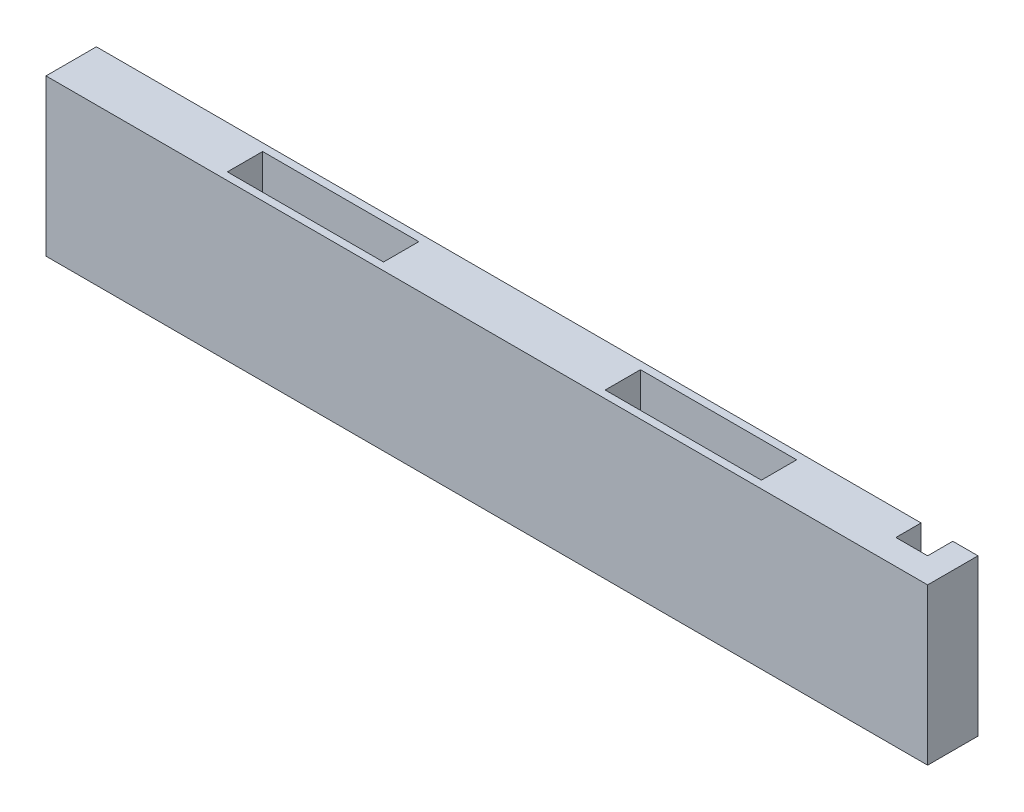
ISO-10303-21;
HEADER;
FILE_DESCRIPTION(('STEP AP214'),'2;1');
FILE_NAME('part.step','',(''),(''),'','','');
FILE_SCHEMA(('AUTOMOTIVE_DESIGN { 1 0 10303 214 1 1 1 1 }'));
ENDSEC;
DATA;
#1=APPLICATION_CONTEXT('core data for automotive mechanical design processes');
#2=APPLICATION_PROTOCOL_DEFINITION('international standard','automotive_design',2000,#1);
#3=PRODUCT_CONTEXT('',#1,'mechanical');
#4=PRODUCT('Part','Part','',(#3));
#5=PRODUCT_RELATED_PRODUCT_CATEGORY('part','',(#4));
#6=PRODUCT_DEFINITION_FORMATION('','',#4);
#7=PRODUCT_DEFINITION_CONTEXT('part definition',#1,'design');
#8=PRODUCT_DEFINITION('design','',#6,#7);
#9=PRODUCT_DEFINITION_SHAPE('','',#8);
#10=(LENGTH_UNIT() NAMED_UNIT(*) SI_UNIT(.MILLI.,.METRE.));
#11=(NAMED_UNIT(*) PLANE_ANGLE_UNIT() SI_UNIT($,.RADIAN.));
#12=(NAMED_UNIT(*) SI_UNIT($,.STERADIAN.) SOLID_ANGLE_UNIT());
#13=UNCERTAINTY_MEASURE_WITH_UNIT(LENGTH_MEASURE(1.E-05),#10,'distance_accuracy_value','');
#14=(GEOMETRIC_REPRESENTATION_CONTEXT(3) GLOBAL_UNCERTAINTY_ASSIGNED_CONTEXT((#13)) GLOBAL_UNIT_ASSIGNED_CONTEXT((#10,
#11,#12)) REPRESENTATION_CONTEXT('',''));
#15=CARTESIAN_POINT('',(0.,0.,0.));
#16=DIRECTION('',(0.,0.,1.));
#17=DIRECTION('',(1.,0.,0.));
#18=AXIS2_PLACEMENT_3D('',#15,#16,#17);
#19=CARTESIAN_POINT('',(0.,0.,0.));
#20=DIRECTION('',(0.,0.,1.));
#21=DIRECTION('',(1.,0.,0.));
#22=AXIS2_PLACEMENT_3D('',#19,#20,#21);
#23=PLANE('',#22);
#24=DIRECTION('',(0.,1.,0.));
#25=VECTOR('',#24,1.);
#26=CARTESIAN_POINT('',(76.2,-15.5,0.));
#27=LINE('',#26,#25);
#28=CARTESIAN_POINT('',(76.2,2.5,0.));
#29=VERTEX_POINT('',#28);
#30=CARTESIAN_POINT('',(76.2,15.5,0.));
#31=VERTEX_POINT('',#30);
#32=EDGE_CURVE('E431',#29,#31,#27,.T.);
#33=ORIENTED_EDGE('',*,*,#32,.F.);
#34=DIRECTION('',(-1.,0.,0.));
#35=VECTOR('',#34,1.);
#36=CARTESIAN_POINT('',(84.9172339781055,2.5,0.));
#37=LINE('',#36,#35);
#38=CARTESIAN_POINT('',(-87.5,2.5,0.));
#39=VERTEX_POINT('',#38);
#40=EDGE_CURVE('E460',#29,#39,#37,.T.);
#41=ORIENTED_EDGE('',*,*,#40,.T.);
#42=DIRECTION('',(0.,-1.,0.));
#43=VECTOR('',#42,1.);
#44=CARTESIAN_POINT('',(-87.5,-15.5,0.));
#45=LINE('',#44,#43);
#46=CARTESIAN_POINT('',(-87.5,15.5,0.));
#47=VERTEX_POINT('',#46);
#48=EDGE_CURVE('E241',#47,#39,#45,.T.);
#49=ORIENTED_EDGE('',*,*,#48,.F.);
#50=DIRECTION('',(-1.,0.,0.));
#51=VECTOR('',#50,1.);
#52=CARTESIAN_POINT('',(87.5,15.5,0.));
#53=LINE('',#52,#51);
#54=EDGE_CURVE('E254',#31,#47,#53,.T.);
#55=ORIENTED_EDGE('',*,*,#54,.F.);
#56=EDGE_LOOP('',(#33,#41,#49,#55));
#57=FACE_BOUND('',#56,.T.);
#58=ADVANCED_FACE('F32',(#57),#23,.F.);
#59=CARTESIAN_POINT('',(76.2,-15.5,5.));
#60=DIRECTION('',(-1.,0.,0.));
#61=DIRECTION('',(0.,0.,1.));
#62=AXIS2_PLACEMENT_3D('',#59,#60,#61);
#63=PLANE('',#62);
#64=DIRECTION('',(0.,1.,0.));
#65=VECTOR('',#64,1.);
#66=CARTESIAN_POINT('',(76.2,-15.5,5.));
#67=LINE('',#66,#65);
#68=CARTESIAN_POINT('',(76.2,-1.00103769104853,5.));
#69=VERTEX_POINT('',#68);
#70=CARTESIAN_POINT('',(76.2,15.5,5.));
#71=VERTEX_POINT('',#70);
#72=EDGE_CURVE('E440',#69,#71,#67,.T.);
#73=ORIENTED_EDGE('',*,*,#72,.F.);
#74=DIRECTION('',(0.,-0.573576436351044,0.819152044288993));
#75=VECTOR('',#74,1.);
#76=CARTESIAN_POINT('',(76.2,2.5,0.));
#77=LINE('',#76,#75);
#78=EDGE_CURVE('E47',#29,#69,#77,.T.);
#79=ORIENTED_EDGE('',*,*,#78,.F.);
#80=ORIENTED_EDGE('',*,*,#32,.T.);
#81=DIRECTION('',(0.,0.,-1.));
#82=VECTOR('',#81,1.);
#83=CARTESIAN_POINT('',(76.2,15.5,5.));
#84=LINE('',#83,#82);
#85=EDGE_CURVE('E424',#71,#31,#84,.T.);
#86=ORIENTED_EDGE('',*,*,#85,.F.);
#87=EDGE_LOOP('',(#73,#79,#80,#86));
#88=FACE_BOUND('',#87,.T.);
#89=ADVANCED_FACE('F475',(#88),#63,.F.);
#90=DIRECTION('',(1.,0.,0.));
#91=VECTOR('',#90,1.);
#92=CARTESIAN_POINT('',(87.5,-15.5,0.));
#93=LINE('',#92,#91);
#94=CARTESIAN_POINT('',(82.5,-15.5,0.));
#95=VERTEX_POINT('',#94);
#96=CARTESIAN_POINT('',(87.5,-15.5,0.));
#97=VERTEX_POINT('',#96);
#98=EDGE_CURVE('E244',#95,#97,#93,.T.);
#99=ORIENTED_EDGE('',*,*,#98,.F.);
#100=DIRECTION('',(0.,-1.,0.));
#101=VECTOR('',#100,1.);
#102=CARTESIAN_POINT('',(82.5,-15.5,0.));
#103=LINE('',#102,#101);
#104=CARTESIAN_POINT('',(82.5,15.5,0.));
#105=VERTEX_POINT('',#104);
#106=EDGE_CURVE('E278',#105,#95,#103,.T.);
#107=ORIENTED_EDGE('',*,*,#106,.F.);
#108=CARTESIAN_POINT('',(87.5,15.5,0.));
#109=VERTEX_POINT('',#108);
#110=EDGE_CURVE('E255',#109,#105,#53,.T.);
#111=ORIENTED_EDGE('',*,*,#110,.F.);
#112=DIRECTION('',(0.,1.,0.));
#113=VECTOR('',#112,1.);
#114=CARTESIAN_POINT('',(87.5,-15.5,0.));
#115=LINE('',#114,#113);
#116=EDGE_CURVE('E252',#97,#109,#115,.T.);
#117=ORIENTED_EDGE('',*,*,#116,.F.);
#118=EDGE_LOOP('',(#99,#107,#111,#117));
#119=FACE_BOUND('',#118,.T.);
#120=ADVANCED_FACE('F276',(#119),#23,.F.);
#121=CARTESIAN_POINT('',(-87.5,-15.5,10.));
#122=DIRECTION('',(1.,0.,0.));
#123=DIRECTION('',(0.,0.,-1.));
#124=AXIS2_PLACEMENT_3D('',#121,#122,#123);
#125=PLANE('',#124);
#126=CARTESIAN_POINT('',(-87.5,10.5,5.));
#127=DIRECTION('',(-1.,0.,0.));
#128=DIRECTION('',(0.,0.,1.));
#129=AXIS2_PLACEMENT_3D('',#126,#127,#128);
#130=CIRCLE('',#129,1.5);
#131=CARTESIAN_POINT('',(-87.5,10.5,6.5));
#132=VERTEX_POINT('',#131);
#133=EDGE_CURVE('E453',#132,#132,#130,.T.);
#134=ORIENTED_EDGE('',*,*,#133,.F.);
#135=EDGE_LOOP('',(#134));
#136=FACE_BOUND('',#135,.T.);
#137=CARTESIAN_POINT('',(-87.5,-10.5,5.));
#138=DIRECTION('',(-1.,0.,0.));
#139=DIRECTION('',(0.,0.,-1.));
#140=AXIS2_PLACEMENT_3D('',#137,#138,#139);
#141=CIRCLE('',#140,1.5);
#142=CARTESIAN_POINT('',(-87.5,-10.5,3.5));
#143=VERTEX_POINT('',#142);
#144=EDGE_CURVE('E446',#143,#143,#141,.T.);
#145=ORIENTED_EDGE('',*,*,#144,.F.);
#146=EDGE_LOOP('',(#145));
#147=FACE_BOUND('',#146,.T.);
#148=ORIENTED_EDGE('',*,*,#48,.T.);
#149=DIRECTION('',(0.,0.573576436351044,-0.819152044288993));
#150=VECTOR('',#149,1.);
#151=CARTESIAN_POINT('',(-87.5,2.5,0.));
#152=LINE('',#151,#150);
#153=CARTESIAN_POINT('',(-87.5,-2.5,7.14074003371061));
#154=VERTEX_POINT('',#153);
#155=EDGE_CURVE('E230',#154,#39,#152,.T.);
#156=ORIENTED_EDGE('',*,*,#155,.F.);
#157=DIRECTION('',(0.,0.,1.));
#158=VECTOR('',#157,1.);
#159=CARTESIAN_POINT('',(-87.5,-2.5,0.));
#160=LINE('',#159,#158);
#161=CARTESIAN_POINT('',(-87.5,-2.5,0.));
#162=VERTEX_POINT('',#161);
#163=EDGE_CURVE('E223',#162,#154,#160,.T.);
#164=ORIENTED_EDGE('',*,*,#163,.F.);
#165=CARTESIAN_POINT('',(-87.5,-15.5,0.));
#166=VERTEX_POINT('',#165);
#167=EDGE_CURVE('E235',#162,#166,#45,.T.);
#168=ORIENTED_EDGE('',*,*,#167,.T.);
#169=DIRECTION('',(0.,0.,-1.));
#170=VECTOR('',#169,1.);
#171=CARTESIAN_POINT('',(-87.5,-15.5,10.));
#172=LINE('',#171,#170);
#173=CARTESIAN_POINT('',(-87.5,-15.5,10.));
#174=VERTEX_POINT('',#173);
#175=EDGE_CURVE('E11',#174,#166,#172,.T.);
#176=ORIENTED_EDGE('',*,*,#175,.F.);
#177=DIRECTION('',(0.,-1.,0.));
#178=VECTOR('',#177,1.);
#179=CARTESIAN_POINT('',(-87.5,-15.5,10.));
#180=LINE('',#179,#178);
#181=CARTESIAN_POINT('',(-87.5,15.5,10.));
#182=VERTEX_POINT('',#181);
#183=EDGE_CURVE('E258',#182,#174,#180,.T.);
#184=ORIENTED_EDGE('',*,*,#183,.F.);
#185=DIRECTION('',(0.,0.,-1.));
#186=VECTOR('',#185,1.);
#187=CARTESIAN_POINT('',(-87.5,15.5,10.));
#188=LINE('',#187,#186);
#189=EDGE_CURVE('E259',#182,#47,#188,.T.);
#190=ORIENTED_EDGE('',*,*,#189,.T.);
#191=EDGE_LOOP('',(#148,#156,#164,#168,#176,#184,#190));
#192=FACE_BOUND('',#191,.T.);
#193=ADVANCED_FACE('F34',(#136,#147,#192),#125,.F.);
#194=CARTESIAN_POINT('',(87.5,-15.5,10.));
#195=DIRECTION('',(0.,1.,0.));
#196=DIRECTION('',(-1.,0.,0.));
#197=AXIS2_PLACEMENT_3D('',#194,#195,#196);
#198=PLANE('',#197);
#199=DIRECTION('',(1.,0.,0.));
#200=VECTOR('',#199,1.);
#201=CARTESIAN_POINT('',(-22.,-15.5,1.5));
#202=LINE('',#201,#200);
#203=CARTESIAN_POINT('',(-53.,-15.5,1.5));
#204=VERTEX_POINT('',#203);
#205=CARTESIAN_POINT('',(-22.,-15.5,1.5));
#206=VERTEX_POINT('',#205);
#207=EDGE_CURVE('E405',#204,#206,#202,.T.);
#208=ORIENTED_EDGE('',*,*,#207,.F.);
#209=DIRECTION('',(0.,0.,-1.));
#210=VECTOR('',#209,1.);
#211=CARTESIAN_POINT('',(-53.,-15.5,1.5));
#212=LINE('',#211,#210);
#213=CARTESIAN_POINT('',(-53.,-15.5,8.5));
#214=VERTEX_POINT('',#213);
#215=EDGE_CURVE('E366',#214,#204,#212,.T.);
#216=ORIENTED_EDGE('',*,*,#215,.F.);
#217=DIRECTION('',(-1.,0.,0.));
#218=VECTOR('',#217,1.);
#219=CARTESIAN_POINT('',(-22.,-15.5,8.5));
#220=LINE('',#219,#218);
#221=CARTESIAN_POINT('',(-22.,-15.5,8.5));
#222=VERTEX_POINT('',#221);
#223=EDGE_CURVE('E398',#222,#214,#220,.T.);
#224=ORIENTED_EDGE('',*,*,#223,.F.);
#225=DIRECTION('',(0.,0.,1.));
#226=VECTOR('',#225,1.);
#227=CARTESIAN_POINT('',(-22.,-15.5,1.5));
#228=LINE('',#227,#226);
#229=EDGE_CURVE('E402',#206,#222,#228,.T.);
#230=ORIENTED_EDGE('',*,*,#229,.F.);
#231=EDGE_LOOP('',(#208,#216,#224,#230));
#232=FACE_BOUND('',#231,.T.);
#233=DIRECTION('',(1.,0.,0.));
#234=VECTOR('',#233,1.);
#235=CARTESIAN_POINT('',(22.,-15.5,1.50000000000001));
#236=LINE('',#235,#234);
#237=CARTESIAN_POINT('',(22.,-15.5,1.50000000000001));
#238=VERTEX_POINT('',#237);
#239=CARTESIAN_POINT('',(53.,-15.5,1.50000000000001));
#240=VERTEX_POINT('',#239);
#241=EDGE_CURVE('E374',#238,#240,#236,.T.);
#242=ORIENTED_EDGE('',*,*,#241,.F.);
#243=DIRECTION('',(0.,0.,-1.));
#244=VECTOR('',#243,1.);
#245=CARTESIAN_POINT('',(22.,-15.5,1.50000000000001));
#246=LINE('',#245,#244);
#247=CARTESIAN_POINT('',(22.,-15.5,8.50000000000001));
#248=VERTEX_POINT('',#247);
#249=EDGE_CURVE('E377',#248,#238,#246,.T.);
#250=ORIENTED_EDGE('',*,*,#249,.F.);
#251=DIRECTION('',(-1.,0.,0.));
#252=VECTOR('',#251,1.);
#253=CARTESIAN_POINT('',(22.,-15.5,8.50000000000001));
#254=LINE('',#253,#252);
#255=CARTESIAN_POINT('',(53.,-15.5,8.50000000000001));
#256=VERTEX_POINT('',#255);
#257=EDGE_CURVE('E367',#256,#248,#254,.T.);
#258=ORIENTED_EDGE('',*,*,#257,.F.);
#259=DIRECTION('',(0.,0.,1.));
#260=VECTOR('',#259,1.);
#261=CARTESIAN_POINT('',(53.,-15.5,1.50000000000001));
#262=LINE('',#261,#260);
#263=EDGE_CURVE('E371',#240,#256,#262,.T.);
#264=ORIENTED_EDGE('',*,*,#263,.F.);
#265=EDGE_LOOP('',(#242,#250,#258,#264));
#266=FACE_BOUND('',#265,.T.);
#267=DIRECTION('',(-1.,0.,0.));
#268=VECTOR('',#267,1.);
#269=CARTESIAN_POINT('',(76.2,-15.5,5.));
#270=LINE('',#269,#268);
#271=CARTESIAN_POINT('',(82.5,-15.5,5.));
#272=VERTEX_POINT('',#271);
#273=CARTESIAN_POINT('',(76.2,-15.5,5.));
#274=VERTEX_POINT('',#273);
#275=EDGE_CURVE('E441',#272,#274,#270,.T.);
#276=ORIENTED_EDGE('',*,*,#275,.F.);
#277=DIRECTION('',(0.,0.,-1.));
#278=VECTOR('',#277,1.);
#279=CARTESIAN_POINT('',(82.5,-15.5,5.));
#280=LINE('',#279,#278);
#281=EDGE_CURVE('E419',#272,#95,#280,.T.);
#282=ORIENTED_EDGE('',*,*,#281,.T.);
#283=ORIENTED_EDGE('',*,*,#98,.T.);
#284=DIRECTION('',(0.,0.,-1.));
#285=VECTOR('',#284,1.);
#286=CARTESIAN_POINT('',(87.5,-15.5,10.));
#287=LINE('',#286,#285);
#288=CARTESIAN_POINT('',(87.5,-15.5,10.));
#289=VERTEX_POINT('',#288);
#290=EDGE_CURVE('E40',#289,#97,#287,.T.);
#291=ORIENTED_EDGE('',*,*,#290,.F.);
#292=DIRECTION('',(1.,0.,0.));
#293=VECTOR('',#292,1.);
#294=CARTESIAN_POINT('',(87.5,-15.5,10.));
#295=LINE('',#294,#293);
#296=EDGE_CURVE('E290',#174,#289,#295,.T.);
#297=ORIENTED_EDGE('',*,*,#296,.F.);
#298=ORIENTED_EDGE('',*,*,#175,.T.);
#299=CARTESIAN_POINT('',(76.2,-15.5,0.));
#300=VERTEX_POINT('',#299);
#301=EDGE_CURVE('E240',#166,#300,#93,.T.);
#302=ORIENTED_EDGE('',*,*,#301,.T.);
#303=DIRECTION('',(0.,0.,-1.));
#304=VECTOR('',#303,1.);
#305=CARTESIAN_POINT('',(76.2,-15.5,5.));
#306=LINE('',#305,#304);
#307=EDGE_CURVE('E55',#274,#300,#306,.T.);
#308=ORIENTED_EDGE('',*,*,#307,.F.);
#309=EDGE_LOOP('',(#276,#282,#283,#291,#297,#298,#302,#308));
#310=FACE_BOUND('',#309,.T.);
#311=ADVANCED_FACE('F482',(#232,#266,#310),#198,.F.);
#312=CARTESIAN_POINT('',(87.5,-15.5,10.));
#313=DIRECTION('',(-1.,0.,0.));
#314=DIRECTION('',(0.,0.,1.));
#315=AXIS2_PLACEMENT_3D('',#312,#313,#314);
#316=PLANE('',#315);
#317=ORIENTED_EDGE('',*,*,#116,.T.);
#318=DIRECTION('',(0.,0.,-1.));
#319=VECTOR('',#318,1.);
#320=CARTESIAN_POINT('',(87.5,15.5,10.));
#321=LINE('',#320,#319);
#322=CARTESIAN_POINT('',(87.5,15.5,10.));
#323=VERTEX_POINT('',#322);
#324=EDGE_CURVE('E262',#323,#109,#321,.T.);
#325=ORIENTED_EDGE('',*,*,#324,.F.);
#326=DIRECTION('',(0.,1.,0.));
#327=VECTOR('',#326,1.);
#328=CARTESIAN_POINT('',(87.5,-15.5,10.));
#329=LINE('',#328,#327);
#330=EDGE_CURVE('E271',#289,#323,#329,.T.);
#331=ORIENTED_EDGE('',*,*,#330,.F.);
#332=ORIENTED_EDGE('',*,*,#290,.T.);
#333=EDGE_LOOP('',(#317,#325,#331,#332));
#334=FACE_BOUND('',#333,.T.);
#335=ADVANCED_FACE('F269',(#334),#316,.F.);
#336=CARTESIAN_POINT('',(87.5,15.5,10.));
#337=DIRECTION('',(0.,-1.,0.));
#338=DIRECTION('',(1.,0.,0.));
#339=AXIS2_PLACEMENT_3D('',#336,#337,#338);
#340=PLANE('',#339);
#341=ORIENTED_EDGE('',*,*,#110,.T.);
#342=DIRECTION('',(0.,0.,-1.));
#343=VECTOR('',#342,1.);
#344=CARTESIAN_POINT('',(82.5,15.5,5.));
#345=LINE('',#344,#343);
#346=CARTESIAN_POINT('',(82.5,15.5,5.));
#347=VERTEX_POINT('',#346);
#348=EDGE_CURVE('E284',#347,#105,#345,.T.);
#349=ORIENTED_EDGE('',*,*,#348,.F.);
#350=DIRECTION('',(1.,0.,0.));
#351=VECTOR('',#350,1.);
#352=CARTESIAN_POINT('',(76.2,15.5,5.));
#353=LINE('',#352,#351);
#354=EDGE_CURVE('E422',#71,#347,#353,.T.);
#355=ORIENTED_EDGE('',*,*,#354,.F.);
#356=ORIENTED_EDGE('',*,*,#85,.T.);
#357=ORIENTED_EDGE('',*,*,#54,.T.);
#358=ORIENTED_EDGE('',*,*,#189,.F.);
#359=DIRECTION('',(-1.,0.,0.));
#360=VECTOR('',#359,1.);
#361=CARTESIAN_POINT('',(87.5,15.5,10.));
#362=LINE('',#361,#360);
#363=EDGE_CURVE('E249',#323,#182,#362,.T.);
#364=ORIENTED_EDGE('',*,*,#363,.F.);
#365=ORIENTED_EDGE('',*,*,#324,.T.);
#366=EDGE_LOOP('',(#341,#349,#355,#356,#357,#358,#364,#365));
#367=FACE_BOUND('',#366,.T.);
#368=DIRECTION('',(1.,0.,0.));
#369=VECTOR('',#368,1.);
#370=CARTESIAN_POINT('',(-22.,15.5,8.49999999999998));
#371=LINE('',#370,#369);
#372=CARTESIAN_POINT('',(-53.,15.5,8.49999999999999));
#373=VERTEX_POINT('',#372);
#374=CARTESIAN_POINT('',(-22.,15.5,8.49999999999998));
#375=VERTEX_POINT('',#374);
#376=EDGE_CURVE('E342',#373,#375,#371,.T.);
#377=ORIENTED_EDGE('',*,*,#376,.F.);
#378=DIRECTION('',(0.,0.,1.));
#379=VECTOR('',#378,1.);
#380=CARTESIAN_POINT('',(-53.,15.5,8.49999999999999));
#381=LINE('',#380,#379);
#382=CARTESIAN_POINT('',(-53.,15.5,1.49999999999999));
#383=VERTEX_POINT('',#382);
#384=EDGE_CURVE('E304',#383,#373,#381,.T.);
#385=ORIENTED_EDGE('',*,*,#384,.F.);
#386=DIRECTION('',(-1.,0.,0.));
#387=VECTOR('',#386,1.);
#388=CARTESIAN_POINT('',(-22.,15.5,1.49999999999998));
#389=LINE('',#388,#387);
#390=CARTESIAN_POINT('',(-22.,15.5,1.49999999999998));
#391=VERTEX_POINT('',#390);
#392=EDGE_CURVE('E335',#391,#383,#389,.T.);
#393=ORIENTED_EDGE('',*,*,#392,.F.);
#394=DIRECTION('',(0.,0.,-1.));
#395=VECTOR('',#394,1.);
#396=CARTESIAN_POINT('',(-22.,15.5,8.49999999999998));
#397=LINE('',#396,#395);
#398=EDGE_CURVE('E339',#375,#391,#397,.T.);
#399=ORIENTED_EDGE('',*,*,#398,.F.);
#400=EDGE_LOOP('',(#377,#385,#393,#399));
#401=FACE_BOUND('',#400,.T.);
#402=DIRECTION('',(1.,0.,0.));
#403=VECTOR('',#402,1.);
#404=CARTESIAN_POINT('',(22.,15.5,8.49999999999998));
#405=LINE('',#404,#403);
#406=CARTESIAN_POINT('',(22.,15.5,8.49999999999998));
#407=VERTEX_POINT('',#406);
#408=CARTESIAN_POINT('',(53.,15.5,8.49999999999998));
#409=VERTEX_POINT('',#408);
#410=EDGE_CURVE('E312',#407,#409,#405,.T.);
#411=ORIENTED_EDGE('',*,*,#410,.F.);
#412=DIRECTION('',(0.,0.,1.));
#413=VECTOR('',#412,1.);
#414=CARTESIAN_POINT('',(22.,15.5,8.49999999999998));
#415=LINE('',#414,#413);
#416=CARTESIAN_POINT('',(22.,15.5,1.49999999999998));
#417=VERTEX_POINT('',#416);
#418=EDGE_CURVE('E315',#417,#407,#415,.T.);
#419=ORIENTED_EDGE('',*,*,#418,.F.);
#420=DIRECTION('',(-1.,0.,0.));
#421=VECTOR('',#420,1.);
#422=CARTESIAN_POINT('',(22.,15.5,1.49999999999998));
#423=LINE('',#422,#421);
#424=CARTESIAN_POINT('',(53.,15.5,1.49999999999998));
#425=VERTEX_POINT('',#424);
#426=EDGE_CURVE('E305',#425,#417,#423,.T.);
#427=ORIENTED_EDGE('',*,*,#426,.F.);
#428=DIRECTION('',(0.,0.,-1.));
#429=VECTOR('',#428,1.);
#430=CARTESIAN_POINT('',(53.,15.5,8.49999999999998));
#431=LINE('',#430,#429);
#432=EDGE_CURVE('E309',#409,#425,#431,.T.);
#433=ORIENTED_EDGE('',*,*,#432,.F.);
#434=EDGE_LOOP('',(#411,#419,#427,#433));
#435=FACE_BOUND('',#434,.T.);
#436=ADVANCED_FACE('F281',(#367,#401,#435),#340,.F.);
#437=CARTESIAN_POINT('',(0.,0.,10.));
#438=DIRECTION('',(0.,0.,1.));
#439=DIRECTION('',(1.,0.,0.));
#440=AXIS2_PLACEMENT_3D('',#437,#438,#439);
#441=PLANE('',#440);
#442=ORIENTED_EDGE('',*,*,#183,.T.);
#443=ORIENTED_EDGE('',*,*,#296,.T.);
#444=ORIENTED_EDGE('',*,*,#330,.T.);
#445=ORIENTED_EDGE('',*,*,#363,.T.);
#446=EDGE_LOOP('',(#442,#443,#444,#445));
#447=FACE_BOUND('',#446,.T.);
#448=ADVANCED_FACE('F480',(#447),#441,.T.);
#449=ORIENTED_EDGE('',*,*,#167,.F.);
#450=DIRECTION('',(-1.,0.,0.));
#451=VECTOR('',#450,1.);
#452=CARTESIAN_POINT('',(84.9172339781055,-2.5,0.));
#453=LINE('',#452,#451);
#454=CARTESIAN_POINT('',(76.2,-2.5,0.));
#455=VERTEX_POINT('',#454);
#456=EDGE_CURVE('E218',#455,#162,#453,.T.);
#457=ORIENTED_EDGE('',*,*,#456,.F.);
#458=EDGE_CURVE('E428',#300,#455,#27,.T.);
#459=ORIENTED_EDGE('',*,*,#458,.F.);
#460=ORIENTED_EDGE('',*,*,#301,.F.);
#461=EDGE_LOOP('',(#449,#457,#459,#460));
#462=FACE_BOUND('',#461,.T.);
#463=ADVANCED_FACE('F238',(#462),#23,.F.);
#464=CARTESIAN_POINT('',(22.,5.,8.49999999999998));
#465=DIRECTION('',(-1.,0.,0.));
#466=DIRECTION('',(0.,-1.,0.));
#467=AXIS2_PLACEMENT_3D('',#464,#465,#466);
#468=PLANE('',#467);
#469=ORIENTED_EDGE('',*,*,#418,.T.);
#470=DIRECTION('',(0.,1.,0.));
#471=VECTOR('',#470,1.);
#472=CARTESIAN_POINT('',(22.,5.,8.49999999999998));
#473=LINE('',#472,#471);
#474=CARTESIAN_POINT('',(22.,5.,8.49999999999998));
#475=VERTEX_POINT('',#474);
#476=EDGE_CURVE('E294',#475,#407,#473,.T.);
#477=ORIENTED_EDGE('',*,*,#476,.F.);
#478=DIRECTION('',(0.,0.,1.));
#479=VECTOR('',#478,1.);
#480=CARTESIAN_POINT('',(22.,5.,8.49999999999998));
#481=LINE('',#480,#479);
#482=CARTESIAN_POINT('',(22.,5.,1.49999999999998));
#483=VERTEX_POINT('',#482);
#484=EDGE_CURVE('E308',#483,#475,#481,.T.);
#485=ORIENTED_EDGE('',*,*,#484,.F.);
#486=DIRECTION('',(0.,1.,0.));
#487=VECTOR('',#486,1.);
#488=CARTESIAN_POINT('',(22.,5.,1.49999999999998));
#489=LINE('',#488,#487);
#490=EDGE_CURVE('E302',#483,#417,#489,.T.);
#491=ORIENTED_EDGE('',*,*,#490,.T.);
#492=EDGE_LOOP('',(#469,#477,#485,#491));
#493=FACE_BOUND('',#492,.T.);
#494=ADVANCED_FACE('F506',(#493),#468,.F.);
#495=CARTESIAN_POINT('',(22.,5.,1.49999999999998));
#496=DIRECTION('',(0.,0.,-1.));
#497=DIRECTION('',(-1.,0.,0.));
#498=AXIS2_PLACEMENT_3D('',#495,#496,#497);
#499=PLANE('',#498);
#500=ORIENTED_EDGE('',*,*,#426,.T.);
#501=ORIENTED_EDGE('',*,*,#490,.F.);
#502=DIRECTION('',(-1.,0.,0.));
#503=VECTOR('',#502,1.);
#504=CARTESIAN_POINT('',(22.,5.,1.49999999999998));
#505=LINE('',#504,#503);
#506=CARTESIAN_POINT('',(53.,5.,1.49999999999998));
#507=VERTEX_POINT('',#506);
#508=EDGE_CURVE('E298',#507,#483,#505,.T.);
#509=ORIENTED_EDGE('',*,*,#508,.F.);
#510=DIRECTION('',(0.,1.,0.));
#511=VECTOR('',#510,1.);
#512=CARTESIAN_POINT('',(53.,5.,1.49999999999998));
#513=LINE('',#512,#511);
#514=EDGE_CURVE('E300',#507,#425,#513,.T.);
#515=ORIENTED_EDGE('',*,*,#514,.T.);
#516=EDGE_LOOP('',(#500,#501,#509,#515));
#517=FACE_BOUND('',#516,.T.);
#518=ADVANCED_FACE('F511',(#517),#499,.F.);
#519=CARTESIAN_POINT('',(53.,5.,8.49999999999998));
#520=DIRECTION('',(1.,0.,0.));
#521=DIRECTION('',(0.,1.,0.));
#522=AXIS2_PLACEMENT_3D('',#519,#520,#521);
#523=PLANE('',#522);
#524=ORIENTED_EDGE('',*,*,#432,.T.);
#525=ORIENTED_EDGE('',*,*,#514,.F.);
#526=DIRECTION('',(0.,0.,-1.));
#527=VECTOR('',#526,1.);
#528=CARTESIAN_POINT('',(53.,5.,8.49999999999998));
#529=LINE('',#528,#527);
#530=CARTESIAN_POINT('',(53.,5.,8.49999999999998));
#531=VERTEX_POINT('',#530);
#532=EDGE_CURVE('E320',#531,#507,#529,.T.);
#533=ORIENTED_EDGE('',*,*,#532,.F.);
#534=DIRECTION('',(0.,1.,0.));
#535=VECTOR('',#534,1.);
#536=CARTESIAN_POINT('',(53.,5.,8.49999999999998));
#537=LINE('',#536,#535);
#538=EDGE_CURVE('E297',#531,#409,#537,.T.);
#539=ORIENTED_EDGE('',*,*,#538,.T.);
#540=EDGE_LOOP('',(#524,#525,#533,#539));
#541=FACE_BOUND('',#540,.T.);
#542=ADVANCED_FACE('F522',(#541),#523,.F.);
#543=CARTESIAN_POINT('',(22.,5.,8.49999999999998));
#544=DIRECTION('',(0.,0.,1.));
#545=DIRECTION('',(1.,0.,0.));
#546=AXIS2_PLACEMENT_3D('',#543,#544,#545);
#547=PLANE('',#546);
#548=ORIENTED_EDGE('',*,*,#410,.T.);
#549=ORIENTED_EDGE('',*,*,#538,.F.);
#550=DIRECTION('',(1.,0.,0.));
#551=VECTOR('',#550,1.);
#552=CARTESIAN_POINT('',(22.,5.,8.49999999999998));
#553=LINE('',#552,#551);
#554=EDGE_CURVE('E323',#475,#531,#553,.T.);
#555=ORIENTED_EDGE('',*,*,#554,.F.);
#556=ORIENTED_EDGE('',*,*,#476,.T.);
#557=EDGE_LOOP('',(#548,#549,#555,#556));
#558=FACE_BOUND('',#557,.T.);
#559=ADVANCED_FACE('F518',(#558),#547,.F.);
#560=CARTESIAN_POINT('',(0.,5.,0.));
#561=DIRECTION('',(0.,-1.,0.));
#562=DIRECTION('',(1.,0.,0.));
#563=AXIS2_PLACEMENT_3D('',#560,#561,#562);
#564=PLANE('',#563);
#565=ORIENTED_EDGE('',*,*,#484,.T.);
#566=ORIENTED_EDGE('',*,*,#554,.T.);
#567=ORIENTED_EDGE('',*,*,#532,.T.);
#568=ORIENTED_EDGE('',*,*,#508,.T.);
#569=EDGE_LOOP('',(#565,#566,#567,#568));
#570=FACE_BOUND('',#569,.T.);
#571=ADVANCED_FACE('F521',(#570),#564,.F.);
#572=CARTESIAN_POINT('',(-53.,4.99999999999999,8.49999999999999));
#573=DIRECTION('',(-1.,0.,0.));
#574=DIRECTION('',(0.,-1.,0.));
#575=AXIS2_PLACEMENT_3D('',#572,#573,#574);
#576=PLANE('',#575);
#577=ORIENTED_EDGE('',*,*,#384,.T.);
#578=DIRECTION('',(0.,1.,0.));
#579=VECTOR('',#578,1.);
#580=CARTESIAN_POINT('',(-53.,4.99999999999999,8.49999999999999));
#581=LINE('',#580,#579);
#582=CARTESIAN_POINT('',(-53.,4.99999999999999,8.49999999999999));
#583=VERTEX_POINT('',#582);
#584=EDGE_CURVE('E328',#583,#373,#581,.T.);
#585=ORIENTED_EDGE('',*,*,#584,.F.);
#586=DIRECTION('',(0.,0.,1.));
#587=VECTOR('',#586,1.);
#588=CARTESIAN_POINT('',(-53.,4.99999999999999,8.49999999999999));
#589=LINE('',#588,#587);
#590=CARTESIAN_POINT('',(-53.,4.99999999999999,1.49999999999999));
#591=VERTEX_POINT('',#590);
#592=EDGE_CURVE('E338',#591,#583,#589,.T.);
#593=ORIENTED_EDGE('',*,*,#592,.F.);
#594=DIRECTION('',(0.,1.,0.));
#595=VECTOR('',#594,1.);
#596=CARTESIAN_POINT('',(-53.,4.99999999999999,1.49999999999999));
#597=LINE('',#596,#595);
#598=EDGE_CURVE('E242',#591,#383,#597,.T.);
#599=ORIENTED_EDGE('',*,*,#598,.T.);
#600=EDGE_LOOP('',(#577,#585,#593,#599));
#601=FACE_BOUND('',#600,.T.);
#602=ADVANCED_FACE('F532',(#601),#576,.F.);
#603=CARTESIAN_POINT('',(-22.,4.99999999999999,1.49999999999998));
#604=DIRECTION('',(0.,0.,-1.));
#605=DIRECTION('',(-1.,0.,0.));
#606=AXIS2_PLACEMENT_3D('',#603,#604,#605);
#607=PLANE('',#606);
#608=ORIENTED_EDGE('',*,*,#392,.T.);
#609=ORIENTED_EDGE('',*,*,#598,.F.);
#610=DIRECTION('',(-1.,0.,0.));
#611=VECTOR('',#610,1.);
#612=CARTESIAN_POINT('',(-22.,4.99999999999999,1.49999999999998));
#613=LINE('',#612,#611);
#614=CARTESIAN_POINT('',(-22.,4.99999999999999,1.49999999999998));
#615=VERTEX_POINT('',#614);
#616=EDGE_CURVE('E332',#615,#591,#613,.T.);
#617=ORIENTED_EDGE('',*,*,#616,.F.);
#618=DIRECTION('',(0.,1.,0.));
#619=VECTOR('',#618,1.);
#620=CARTESIAN_POINT('',(-22.,4.99999999999999,1.49999999999998));
#621=LINE('',#620,#619);
#622=EDGE_CURVE('E245',#615,#391,#621,.T.);
#623=ORIENTED_EDGE('',*,*,#622,.T.);
#624=EDGE_LOOP('',(#608,#609,#617,#623));
#625=FACE_BOUND('',#624,.T.);
#626=ADVANCED_FACE('F536',(#625),#607,.F.);
#627=CARTESIAN_POINT('',(-22.,4.99999999999999,8.49999999999998));
#628=DIRECTION('',(1.,0.,0.));
#629=DIRECTION('',(0.,1.,0.));
#630=AXIS2_PLACEMENT_3D('',#627,#628,#629);
#631=PLANE('',#630);
#632=ORIENTED_EDGE('',*,*,#398,.T.);
#633=ORIENTED_EDGE('',*,*,#622,.F.);
#634=DIRECTION('',(0.,0.,-1.));
#635=VECTOR('',#634,1.);
#636=CARTESIAN_POINT('',(-22.,4.99999999999999,8.49999999999998));
#637=LINE('',#636,#635);
#638=CARTESIAN_POINT('',(-22.,4.99999999999999,8.49999999999998));
#639=VERTEX_POINT('',#638);
#640=EDGE_CURVE('E348',#639,#615,#637,.T.);
#641=ORIENTED_EDGE('',*,*,#640,.F.);
#642=DIRECTION('',(0.,1.,0.));
#643=VECTOR('',#642,1.);
#644=CARTESIAN_POINT('',(-22.,4.99999999999999,8.49999999999998));
#645=LINE('',#644,#643);
#646=EDGE_CURVE('E331',#639,#375,#645,.T.);
#647=ORIENTED_EDGE('',*,*,#646,.T.);
#648=EDGE_LOOP('',(#632,#633,#641,#647));
#649=FACE_BOUND('',#648,.T.);
#650=ADVANCED_FACE('F542',(#649),#631,.F.);
#651=CARTESIAN_POINT('',(-22.,4.99999999999999,8.49999999999998));
#652=DIRECTION('',(0.,0.,1.));
#653=DIRECTION('',(1.,0.,0.));
#654=AXIS2_PLACEMENT_3D('',#651,#652,#653);
#655=PLANE('',#654);
#656=ORIENTED_EDGE('',*,*,#376,.T.);
#657=ORIENTED_EDGE('',*,*,#646,.F.);
#658=DIRECTION('',(1.,0.,0.));
#659=VECTOR('',#658,1.);
#660=CARTESIAN_POINT('',(-22.,4.99999999999999,8.49999999999998));
#661=LINE('',#660,#659);
#662=EDGE_CURVE('E351',#583,#639,#661,.T.);
#663=ORIENTED_EDGE('',*,*,#662,.F.);
#664=ORIENTED_EDGE('',*,*,#584,.T.);
#665=EDGE_LOOP('',(#656,#657,#663,#664));
#666=FACE_BOUND('',#665,.T.);
#667=ADVANCED_FACE('F538',(#666),#655,.F.);
#668=CARTESIAN_POINT('',(0.,5.,0.));
#669=DIRECTION('',(0.,1.,0.));
#670=DIRECTION('',(-1.,0.,0.));
#671=AXIS2_PLACEMENT_3D('',#668,#669,#670);
#672=PLANE('',#671);
#673=ORIENTED_EDGE('',*,*,#592,.T.);
#674=ORIENTED_EDGE('',*,*,#662,.T.);
#675=ORIENTED_EDGE('',*,*,#640,.T.);
#676=ORIENTED_EDGE('',*,*,#616,.T.);
#677=EDGE_LOOP('',(#673,#674,#675,#676));
#678=FACE_BOUND('',#677,.T.);
#679=ADVANCED_FACE('F541',(#678),#672,.T.);
#680=CARTESIAN_POINT('',(22.,-5.,1.50000000000001));
#681=DIRECTION('',(-1.,0.,0.));
#682=DIRECTION('',(0.,0.,1.));
#683=AXIS2_PLACEMENT_3D('',#680,#681,#682);
#684=PLANE('',#683);
#685=ORIENTED_EDGE('',*,*,#249,.T.);
#686=DIRECTION('',(0.,-1.,0.));
#687=VECTOR('',#686,1.);
#688=CARTESIAN_POINT('',(22.,-5.,1.50000000000001));
#689=LINE('',#688,#687);
#690=CARTESIAN_POINT('',(22.,-5.,1.50000000000001));
#691=VERTEX_POINT('',#690);
#692=EDGE_CURVE('E356',#691,#238,#689,.T.);
#693=ORIENTED_EDGE('',*,*,#692,.F.);
#694=DIRECTION('',(0.,0.,-1.));
#695=VECTOR('',#694,1.);
#696=CARTESIAN_POINT('',(22.,-5.,1.50000000000001));
#697=LINE('',#696,#695);
#698=CARTESIAN_POINT('',(22.,-5.,8.50000000000001));
#699=VERTEX_POINT('',#698);
#700=EDGE_CURVE('E370',#699,#691,#697,.T.);
#701=ORIENTED_EDGE('',*,*,#700,.F.);
#702=DIRECTION('',(0.,-1.,0.));
#703=VECTOR('',#702,1.);
#704=CARTESIAN_POINT('',(22.,-5.,8.50000000000001));
#705=LINE('',#704,#703);
#706=EDGE_CURVE('E364',#699,#248,#705,.T.);
#707=ORIENTED_EDGE('',*,*,#706,.T.);
#708=EDGE_LOOP('',(#685,#693,#701,#707));
#709=FACE_BOUND('',#708,.T.);
#710=ADVANCED_FACE('F552',(#709),#684,.F.);
#711=CARTESIAN_POINT('',(22.,-5.,8.50000000000001));
#712=DIRECTION('',(0.,0.,1.));
#713=DIRECTION('',(1.,0.,0.));
#714=AXIS2_PLACEMENT_3D('',#711,#712,#713);
#715=PLANE('',#714);
#716=ORIENTED_EDGE('',*,*,#257,.T.);
#717=ORIENTED_EDGE('',*,*,#706,.F.);
#718=DIRECTION('',(-1.,0.,0.));
#719=VECTOR('',#718,1.);
#720=CARTESIAN_POINT('',(22.,-5.,8.50000000000001));
#721=LINE('',#720,#719);
#722=CARTESIAN_POINT('',(53.,-4.99999999999999,8.50000000000001));
#723=VERTEX_POINT('',#722);
#724=EDGE_CURVE('E360',#723,#699,#721,.T.);
#725=ORIENTED_EDGE('',*,*,#724,.F.);
#726=DIRECTION('',(0.,-1.,0.));
#727=VECTOR('',#726,1.);
#728=CARTESIAN_POINT('',(53.,-4.99999999999999,8.50000000000001));
#729=LINE('',#728,#727);
#730=EDGE_CURVE('E362',#723,#256,#729,.T.);
#731=ORIENTED_EDGE('',*,*,#730,.T.);
#732=EDGE_LOOP('',(#716,#717,#725,#731));
#733=FACE_BOUND('',#732,.T.);
#734=ADVANCED_FACE('F556',(#733),#715,.F.);
#735=CARTESIAN_POINT('',(53.,-4.99999999999999,1.50000000000001));
#736=DIRECTION('',(1.,0.,0.));
#737=DIRECTION('',(0.,1.,0.));
#738=AXIS2_PLACEMENT_3D('',#735,#736,#737);
#739=PLANE('',#738);
#740=ORIENTED_EDGE('',*,*,#263,.T.);
#741=ORIENTED_EDGE('',*,*,#730,.F.);
#742=DIRECTION('',(0.,0.,1.));
#743=VECTOR('',#742,1.);
#744=CARTESIAN_POINT('',(53.,-4.99999999999999,1.50000000000001));
#745=LINE('',#744,#743);
#746=CARTESIAN_POINT('',(53.,-4.99999999999999,1.50000000000001));
#747=VERTEX_POINT('',#746);
#748=EDGE_CURVE('E381',#747,#723,#745,.T.);
#749=ORIENTED_EDGE('',*,*,#748,.F.);
#750=DIRECTION('',(0.,-1.,0.));
#751=VECTOR('',#750,1.);
#752=CARTESIAN_POINT('',(53.,-4.99999999999999,1.50000000000001));
#753=LINE('',#752,#751);
#754=EDGE_CURVE('E359',#747,#240,#753,.T.);
#755=ORIENTED_EDGE('',*,*,#754,.T.);
#756=EDGE_LOOP('',(#740,#741,#749,#755));
#757=FACE_BOUND('',#756,.T.);
#758=ADVANCED_FACE('F562',(#757),#739,.F.);
#759=CARTESIAN_POINT('',(22.,-5.,1.50000000000001));
#760=DIRECTION('',(0.,0.,-1.));
#761=DIRECTION('',(-1.,0.,0.));
#762=AXIS2_PLACEMENT_3D('',#759,#760,#761);
#763=PLANE('',#762);
#764=ORIENTED_EDGE('',*,*,#241,.T.);
#765=ORIENTED_EDGE('',*,*,#754,.F.);
#766=DIRECTION('',(1.,0.,0.));
#767=VECTOR('',#766,1.);
#768=CARTESIAN_POINT('',(22.,-5.,1.50000000000001));
#769=LINE('',#768,#767);
#770=EDGE_CURVE('E384',#691,#747,#769,.T.);
#771=ORIENTED_EDGE('',*,*,#770,.F.);
#772=ORIENTED_EDGE('',*,*,#692,.T.);
#773=EDGE_LOOP('',(#764,#765,#771,#772));
#774=FACE_BOUND('',#773,.T.);
#775=ADVANCED_FACE('F558',(#774),#763,.F.);
#776=CARTESIAN_POINT('',(0.,-5.,0.));
#777=DIRECTION('',(0.,1.,0.));
#778=DIRECTION('',(-1.,0.,0.));
#779=AXIS2_PLACEMENT_3D('',#776,#777,#778);
#780=PLANE('',#779);
#781=ORIENTED_EDGE('',*,*,#700,.T.);
#782=ORIENTED_EDGE('',*,*,#770,.T.);
#783=ORIENTED_EDGE('',*,*,#748,.T.);
#784=ORIENTED_EDGE('',*,*,#724,.T.);
#785=EDGE_LOOP('',(#781,#782,#783,#784));
#786=FACE_BOUND('',#785,.T.);
#787=ADVANCED_FACE('F561',(#786),#780,.F.);
#788=CARTESIAN_POINT('',(-53.,-5.00000000000001,1.5));
#789=DIRECTION('',(-1.,0.,0.));
#790=DIRECTION('',(0.,-1.,0.));
#791=AXIS2_PLACEMENT_3D('',#788,#789,#790);
#792=PLANE('',#791);
#793=ORIENTED_EDGE('',*,*,#215,.T.);
#794=DIRECTION('',(0.,-1.,0.));
#795=VECTOR('',#794,1.);
#796=CARTESIAN_POINT('',(-53.,-5.00000000000001,1.5));
#797=LINE('',#796,#795);
#798=CARTESIAN_POINT('',(-53.,-5.00000000000001,1.5));
#799=VERTEX_POINT('',#798);
#800=EDGE_CURVE('E389',#799,#204,#797,.T.);
#801=ORIENTED_EDGE('',*,*,#800,.F.);
#802=DIRECTION('',(0.,0.,-1.));
#803=VECTOR('',#802,1.);
#804=CARTESIAN_POINT('',(-53.,-5.00000000000001,1.5));
#805=LINE('',#804,#803);
#806=CARTESIAN_POINT('',(-53.,-5.00000000000001,8.5));
#807=VERTEX_POINT('',#806);
#808=EDGE_CURVE('E401',#807,#799,#805,.T.);
#809=ORIENTED_EDGE('',*,*,#808,.F.);
#810=DIRECTION('',(0.,-1.,0.));
#811=VECTOR('',#810,1.);
#812=CARTESIAN_POINT('',(-53.,-5.00000000000001,8.5));
#813=LINE('',#812,#811);
#814=EDGE_CURVE('E317',#807,#214,#813,.T.);
#815=ORIENTED_EDGE('',*,*,#814,.T.);
#816=EDGE_LOOP('',(#793,#801,#809,#815));
#817=FACE_BOUND('',#816,.T.);
#818=ADVANCED_FACE('F572',(#817),#792,.F.);
#819=CARTESIAN_POINT('',(-22.,-5.00000000000001,8.5));
#820=DIRECTION('',(0.,0.,1.));
#821=DIRECTION('',(1.,0.,0.));
#822=AXIS2_PLACEMENT_3D('',#819,#820,#821);
#823=PLANE('',#822);
#824=ORIENTED_EDGE('',*,*,#223,.T.);
#825=ORIENTED_EDGE('',*,*,#814,.F.);
#826=DIRECTION('',(-1.,0.,0.));
#827=VECTOR('',#826,1.);
#828=CARTESIAN_POINT('',(-22.,-5.00000000000001,8.5));
#829=LINE('',#828,#827);
#830=CARTESIAN_POINT('',(-22.,-5.00000000000001,8.5));
#831=VERTEX_POINT('',#830);
#832=EDGE_CURVE('E393',#831,#807,#829,.T.);
#833=ORIENTED_EDGE('',*,*,#832,.F.);
#834=DIRECTION('',(0.,-1.,0.));
#835=VECTOR('',#834,1.);
#836=CARTESIAN_POINT('',(-22.,-5.00000000000001,8.5));
#837=LINE('',#836,#835);
#838=EDGE_CURVE('E395',#831,#222,#837,.T.);
#839=ORIENTED_EDGE('',*,*,#838,.T.);
#840=EDGE_LOOP('',(#824,#825,#833,#839));
#841=FACE_BOUND('',#840,.T.);
#842=ADVANCED_FACE('F576',(#841),#823,.F.);
#843=CARTESIAN_POINT('',(-22.,-5.00000000000001,1.5));
#844=DIRECTION('',(1.,0.,0.));
#845=DIRECTION('',(0.,1.,0.));
#846=AXIS2_PLACEMENT_3D('',#843,#844,#845);
#847=PLANE('',#846);
#848=ORIENTED_EDGE('',*,*,#229,.T.);
#849=ORIENTED_EDGE('',*,*,#838,.F.);
#850=DIRECTION('',(0.,0.,1.));
#851=VECTOR('',#850,1.);
#852=CARTESIAN_POINT('',(-22.,-5.00000000000001,1.5));
#853=LINE('',#852,#851);
#854=CARTESIAN_POINT('',(-22.,-5.00000000000001,1.5));
#855=VERTEX_POINT('',#854);
#856=EDGE_CURVE('E411',#855,#831,#853,.T.);
#857=ORIENTED_EDGE('',*,*,#856,.F.);
#858=DIRECTION('',(0.,-1.,0.));
#859=VECTOR('',#858,1.);
#860=CARTESIAN_POINT('',(-22.,-5.00000000000001,1.5));
#861=LINE('',#860,#859);
#862=EDGE_CURVE('E392',#855,#206,#861,.T.);
#863=ORIENTED_EDGE('',*,*,#862,.T.);
#864=EDGE_LOOP('',(#848,#849,#857,#863));
#865=FACE_BOUND('',#864,.T.);
#866=ADVANCED_FACE('F580',(#865),#847,.F.);
#867=CARTESIAN_POINT('',(-22.,-5.00000000000001,1.5));
#868=DIRECTION('',(0.,0.,-1.));
#869=DIRECTION('',(-1.,0.,0.));
#870=AXIS2_PLACEMENT_3D('',#867,#868,#869);
#871=PLANE('',#870);
#872=ORIENTED_EDGE('',*,*,#207,.T.);
#873=ORIENTED_EDGE('',*,*,#862,.F.);
#874=DIRECTION('',(1.,0.,0.));
#875=VECTOR('',#874,1.);
#876=CARTESIAN_POINT('',(-22.,-5.00000000000001,1.5));
#877=LINE('',#876,#875);
#878=EDGE_CURVE('E414',#799,#855,#877,.T.);
#879=ORIENTED_EDGE('',*,*,#878,.F.);
#880=ORIENTED_EDGE('',*,*,#800,.T.);
#881=EDGE_LOOP('',(#872,#873,#879,#880));
#882=FACE_BOUND('',#881,.T.);
#883=ADVANCED_FACE('F494',(#882),#871,.F.);
#884=CARTESIAN_POINT('',(0.,-5.,0.));
#885=DIRECTION('',(0.,-1.,0.));
#886=DIRECTION('',(1.,0.,0.));
#887=AXIS2_PLACEMENT_3D('',#884,#885,#886);
#888=PLANE('',#887);
#889=ORIENTED_EDGE('',*,*,#808,.T.);
#890=ORIENTED_EDGE('',*,*,#878,.T.);
#891=ORIENTED_EDGE('',*,*,#856,.T.);
#892=ORIENTED_EDGE('',*,*,#832,.T.);
#893=EDGE_LOOP('',(#889,#890,#891,#892));
#894=FACE_BOUND('',#893,.T.);
#895=ADVANCED_FACE('F487',(#894),#888,.T.);
#896=CARTESIAN_POINT('',(82.5,-15.5,5.));
#897=DIRECTION('',(1.,0.,0.));
#898=DIRECTION('',(0.,0.,-1.));
#899=AXIS2_PLACEMENT_3D('',#896,#897,#898);
#900=PLANE('',#899);
#901=ORIENTED_EDGE('',*,*,#106,.T.);
#902=ORIENTED_EDGE('',*,*,#281,.F.);
#903=DIRECTION('',(0.,-1.,0.));
#904=VECTOR('',#903,1.);
#905=CARTESIAN_POINT('',(82.5,-15.5,5.));
#906=LINE('',#905,#904);
#907=EDGE_CURVE('E430',#347,#272,#906,.T.);
#908=ORIENTED_EDGE('',*,*,#907,.F.);
#909=ORIENTED_EDGE('',*,*,#348,.T.);
#910=EDGE_LOOP('',(#901,#902,#908,#909));
#911=FACE_BOUND('',#910,.T.);
#912=ADVANCED_FACE('F484',(#911),#900,.F.);
#913=ORIENTED_EDGE('',*,*,#458,.T.);
#914=DIRECTION('',(0.,0.,-1.));
#915=VECTOR('',#914,1.);
#916=CARTESIAN_POINT('',(76.2,-2.5,0.));
#917=LINE('',#916,#915);
#918=CARTESIAN_POINT('',(76.2,-2.5,5.));
#919=VERTEX_POINT('',#918);
#920=EDGE_CURVE('E226',#919,#455,#917,.T.);
#921=ORIENTED_EDGE('',*,*,#920,.F.);
#922=EDGE_CURVE('E436',#274,#919,#67,.T.);
#923=ORIENTED_EDGE('',*,*,#922,.F.);
#924=ORIENTED_EDGE('',*,*,#307,.T.);
#925=EDGE_LOOP('',(#913,#921,#923,#924));
#926=FACE_BOUND('',#925,.T.);
#927=ADVANCED_FACE('F486',(#926),#63,.F.);
#928=CARTESIAN_POINT('',(0.,0.,5.));
#929=DIRECTION('',(0.,0.,-1.));
#930=DIRECTION('',(-1.,0.,0.));
#931=AXIS2_PLACEMENT_3D('',#928,#929,#930);
#932=PLANE('',#931);
#933=ORIENTED_EDGE('',*,*,#907,.T.);
#934=ORIENTED_EDGE('',*,*,#275,.T.);
#935=ORIENTED_EDGE('',*,*,#922,.T.);
#936=EDGE_CURVE('E439',#919,#69,#67,.T.);
#937=ORIENTED_EDGE('',*,*,#936,.T.);
#938=ORIENTED_EDGE('',*,*,#72,.T.);
#939=ORIENTED_EDGE('',*,*,#354,.T.);
#940=EDGE_LOOP('',(#933,#934,#935,#937,#938,#939));
#941=FACE_BOUND('',#940,.T.);
#942=ADVANCED_FACE('F473',(#941),#932,.T.);
#943=CARTESIAN_POINT('',(-79.5,-10.5,5.));
#944=DIRECTION('',(-1.,0.,0.));
#945=DIRECTION('',(0.,0.,1.));
#946=AXIS2_PLACEMENT_3D('',#943,#944,#945);
#947=CYLINDRICAL_SURFACE('',#946,1.5);
#948=CARTESIAN_POINT('',(-79.5,-10.5,5.));
#949=DIRECTION('',(-1.,0.,0.));
#950=DIRECTION('',(0.,0.,-1.));
#951=AXIS2_PLACEMENT_3D('',#948,#949,#950);
#952=CIRCLE('',#951,1.5);
#953=CARTESIAN_POINT('',(-79.5,-10.5,3.5));
#954=VERTEX_POINT('',#953);
#955=EDGE_CURVE('E449',#954,#954,#952,.T.);
#956=ORIENTED_EDGE('',*,*,#955,.F.);
#957=EDGE_LOOP('',(#956));
#958=FACE_BOUND('',#957,.T.);
#959=ORIENTED_EDGE('',*,*,#144,.T.);
#960=EDGE_LOOP('',(#959));
#961=FACE_BOUND('',#960,.T.);
#962=ADVANCED_FACE('F620',(#958,#961),#947,.F.);
#963=CARTESIAN_POINT('',(-79.5,-10.5,5.));
#964=DIRECTION('',(1.,0.,0.));
#965=DIRECTION('',(0.,0.,-1.));
#966=AXIS2_PLACEMENT_3D('',#963,#964,#965);
#967=PLANE('',#966);
#968=ORIENTED_EDGE('',*,*,#955,.T.);
#969=EDGE_LOOP('',(#968));
#970=FACE_BOUND('',#969,.T.);
#971=ADVANCED_FACE('F622',(#970),#967,.F.);
#972=CARTESIAN_POINT('',(-79.5,10.5,5.));
#973=DIRECTION('',(-1.,0.,0.));
#974=DIRECTION('',(0.,0.,1.));
#975=AXIS2_PLACEMENT_3D('',#972,#973,#974);
#976=CYLINDRICAL_SURFACE('',#975,1.5);
#977=CARTESIAN_POINT('',(-79.5,10.5,5.));
#978=DIRECTION('',(-1.,0.,0.));
#979=DIRECTION('',(0.,0.,1.));
#980=AXIS2_PLACEMENT_3D('',#977,#978,#979);
#981=CIRCLE('',#980,1.5);
#982=CARTESIAN_POINT('',(-79.5,10.5,6.5));
#983=VERTEX_POINT('',#982);
#984=EDGE_CURVE('E433',#983,#983,#981,.T.);
#985=ORIENTED_EDGE('',*,*,#984,.F.);
#986=EDGE_LOOP('',(#985));
#987=FACE_BOUND('',#986,.T.);
#988=ORIENTED_EDGE('',*,*,#133,.T.);
#989=EDGE_LOOP('',(#988));
#990=FACE_BOUND('',#989,.T.);
#991=ADVANCED_FACE('F629',(#987,#990),#976,.F.);
#992=CARTESIAN_POINT('',(-79.5,10.5,5.));
#993=DIRECTION('',(-1.,0.,0.));
#994=DIRECTION('',(0.,0.,1.));
#995=AXIS2_PLACEMENT_3D('',#992,#993,#994);
#996=PLANE('',#995);
#997=ORIENTED_EDGE('',*,*,#984,.T.);
#998=EDGE_LOOP('',(#997));
#999=FACE_BOUND('',#998,.T.);
#1000=ADVANCED_FACE('F637',(#999),#996,.T.);
#1001=CARTESIAN_POINT('',(84.9172339781055,2.5,0.));
#1002=DIRECTION('',(0.,0.819152044288993,0.573576436351044));
#1003=DIRECTION('',(0.,-0.573576436351044,0.819152044288993));
#1004=AXIS2_PLACEMENT_3D('',#1001,#1002,#1003);
#1005=PLANE('',#1004);
#1006=ORIENTED_EDGE('',*,*,#78,.T.);
#1007=CARTESIAN_POINT('',(76.2,-2.5,7.14074003371061));
#1008=VERTEX_POINT('',#1007);
#1009=EDGE_CURVE('E463',#69,#1008,#77,.T.);
#1010=ORIENTED_EDGE('',*,*,#1009,.T.);
#1011=DIRECTION('',(-1.,0.,0.));
#1012=VECTOR('',#1011,1.);
#1013=CARTESIAN_POINT('',(84.9172339781055,-2.5,7.14074003371061));
#1014=LINE('',#1013,#1012);
#1015=EDGE_CURVE('E229',#1008,#154,#1014,.T.);
#1016=ORIENTED_EDGE('',*,*,#1015,.T.);
#1017=ORIENTED_EDGE('',*,*,#155,.T.);
#1018=ORIENTED_EDGE('',*,*,#40,.F.);
#1019=EDGE_LOOP('',(#1006,#1010,#1016,#1017,#1018));
#1020=FACE_BOUND('',#1019,.T.);
#1021=ADVANCED_FACE('F465',(#1020),#1005,.F.);
#1022=CARTESIAN_POINT('',(84.9172339781055,-2.5,0.));
#1023=DIRECTION('',(0.,-1.,0.));
#1024=DIRECTION('',(0.,0.,-1.));
#1025=AXIS2_PLACEMENT_3D('',#1022,#1023,#1024);
#1026=PLANE('',#1025);
#1027=EDGE_CURVE('E450',#1008,#919,#917,.T.);
#1028=ORIENTED_EDGE('',*,*,#1027,.T.);
#1029=ORIENTED_EDGE('',*,*,#920,.T.);
#1030=ORIENTED_EDGE('',*,*,#456,.T.);
#1031=ORIENTED_EDGE('',*,*,#163,.T.);
#1032=ORIENTED_EDGE('',*,*,#1015,.F.);
#1033=EDGE_LOOP('',(#1028,#1029,#1030,#1031,#1032));
#1034=FACE_BOUND('',#1033,.T.);
#1035=ADVANCED_FACE('F221',(#1034),#1026,.F.);
#1036=CARTESIAN_POINT('',(76.2,-15.5,5.));
#1037=DIRECTION('',(-1.,0.,0.));
#1038=DIRECTION('',(0.,0.,1.));
#1039=AXIS2_PLACEMENT_3D('',#1036,#1037,#1038);
#1040=PLANE('',#1039);
#1041=ORIENTED_EDGE('',*,*,#1027,.F.);
#1042=ORIENTED_EDGE('',*,*,#1009,.F.);
#1043=ORIENTED_EDGE('',*,*,#936,.F.);
#1044=EDGE_LOOP('',(#1041,#1042,#1043));
#1045=FACE_BOUND('',#1044,.T.);
#1046=ADVANCED_FACE('F469',(#1045),#1040,.T.);
#1047=CLOSED_SHELL('',(#58,#89,#120,#193,#311,#335,#436,#448,#463,#494,#518,#542,#559,#571,#602,
#626,#650,#667,#679,#710,#734,#758,#775,#787,#818,#842,#866,#883,#895,#912,#927,#942,#962,#971,
#991,#1000,#1021,#1035,#1046));
#1048=MANIFOLD_SOLID_BREP('B2',#1047);
#1049=ADVANCED_BREP_SHAPE_REPRESENTATION('',(#18,#1048),#14);
#1050=SHAPE_DEFINITION_REPRESENTATION(#9,#1049);
ENDSEC;
END-ISO-10303-21;
